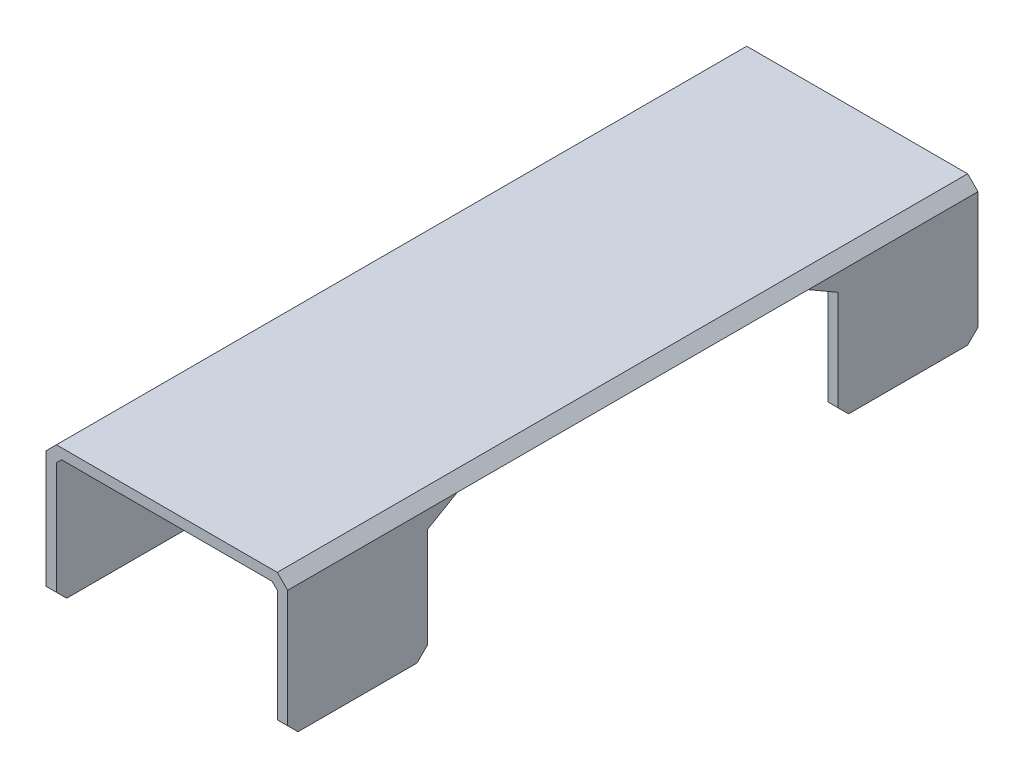
ISO-10303-21;
HEADER;
FILE_DESCRIPTION(('STEP AP214'),'2;1');
FILE_NAME('part.step','',(''),(''),'','','');
FILE_SCHEMA(('AUTOMOTIVE_DESIGN { 1 0 10303 214 1 1 1 1 }'));
ENDSEC;
DATA;
#1=APPLICATION_CONTEXT('core data for automotive mechanical design processes');
#2=APPLICATION_PROTOCOL_DEFINITION('international standard','automotive_design',2000,#1);
#3=PRODUCT_CONTEXT('',#1,'mechanical');
#4=PRODUCT('Part','Part','',(#3));
#5=PRODUCT_RELATED_PRODUCT_CATEGORY('part','',(#4));
#6=PRODUCT_DEFINITION_FORMATION('','',#4);
#7=PRODUCT_DEFINITION_CONTEXT('part definition',#1,'design');
#8=PRODUCT_DEFINITION('design','',#6,#7);
#9=PRODUCT_DEFINITION_SHAPE('','',#8);
#10=(LENGTH_UNIT() NAMED_UNIT(*) SI_UNIT(.MILLI.,.METRE.));
#11=(NAMED_UNIT(*) PLANE_ANGLE_UNIT() SI_UNIT($,.RADIAN.));
#12=(NAMED_UNIT(*) SI_UNIT($,.STERADIAN.) SOLID_ANGLE_UNIT());
#13=UNCERTAINTY_MEASURE_WITH_UNIT(LENGTH_MEASURE(1.E-05),#10,'distance_accuracy_value','');
#14=(GEOMETRIC_REPRESENTATION_CONTEXT(3) GLOBAL_UNCERTAINTY_ASSIGNED_CONTEXT((#13)) GLOBAL_UNIT_ASSIGNED_CONTEXT((#10,
#11,#12)) REPRESENTATION_CONTEXT('',''));
#15=CARTESIAN_POINT('',(0.,0.,0.));
#16=DIRECTION('',(0.,0.,1.));
#17=DIRECTION('',(1.,0.,0.));
#18=AXIS2_PLACEMENT_3D('',#15,#16,#17);
#19=CARTESIAN_POINT('',(32.,3.,-140.112342240263));
#20=DIRECTION('',(-1.,0.,0.));
#21=DIRECTION('',(0.,-1.,0.));
#22=AXIS2_PLACEMENT_3D('',#19,#20,#21);
#23=PLANE('',#22);
#24=DIRECTION('',(0.,1.,0.));
#25=VECTOR('',#24,1.);
#26=CARTESIAN_POINT('',(32.,3.,-100.));
#27=LINE('',#26,#25);
#28=CARTESIAN_POINT('',(32.,-34.,-100.));
#29=VERTEX_POINT('',#28);
#30=CARTESIAN_POINT('',(32.,-1.5,-100.));
#31=VERTEX_POINT('',#30);
#32=EDGE_CURVE('E570',#29,#31,#27,.T.);
#33=ORIENTED_EDGE('',*,*,#32,.F.);
#34=DIRECTION('',(0.,-0.707106781186548,0.707106781186548));
#35=VECTOR('',#34,1.);
#36=CARTESIAN_POINT('',(32.,4.5561711201316,-138.556171120132));
#37=LINE('',#36,#35);
#38=CARTESIAN_POINT('',(32.,-37.,-97.));
#39=VERTEX_POINT('',#38);
#40=EDGE_CURVE('E445',#29,#39,#37,.T.);
#41=ORIENTED_EDGE('',*,*,#40,.T.);
#42=DIRECTION('',(0.,0.,1.));
#43=VECTOR('',#42,1.);
#44=CARTESIAN_POINT('',(32.,-37.,-140.112342240263));
#45=LINE('',#44,#43);
#46=CARTESIAN_POINT('',(32.,-37.,-62.5));
#47=VERTEX_POINT('',#46);
#48=EDGE_CURVE('E584',#39,#47,#45,.T.);
#49=ORIENTED_EDGE('',*,*,#48,.T.);
#50=DIRECTION('',(0.,0.707106781186543,0.707106781186552));
#51=VECTOR('',#50,1.);
#52=CARTESIAN_POINT('',(32.,-55.8061711201318,-81.306171120132));
#53=LINE('',#52,#51);
#54=CARTESIAN_POINT('',(32.,-34.,-59.5));
#55=VERTEX_POINT('',#54);
#56=EDGE_CURVE('E442',#47,#55,#53,.T.);
#57=ORIENTED_EDGE('',*,*,#56,.T.);
#58=DIRECTION('',(0.,-1.,0.));
#59=VECTOR('',#58,1.);
#60=CARTESIAN_POINT('',(32.,2.99999999999998,-59.5));
#61=LINE('',#60,#59);
#62=CARTESIAN_POINT('',(32.,-4.99999999999998,-59.5));
#63=VERTEX_POINT('',#62);
#64=EDGE_CURVE('E539',#63,#55,#61,.T.);
#65=ORIENTED_EDGE('',*,*,#64,.F.);
#66=DIRECTION('',(0.,0.499999999999995,0.866025403784441));
#67=VECTOR('',#66,1.);
#68=CARTESIAN_POINT('',(32.,0.,-50.8397459621555));
#69=LINE('',#68,#67);
#70=CARTESIAN_POINT('',(32.,-1.5,-53.4378221735089));
#71=VERTEX_POINT('',#70);
#72=EDGE_CURVE('E395',#63,#71,#69,.T.);
#73=ORIENTED_EDGE('',*,*,#72,.T.);
#74=DIRECTION('',(0.,0.,-1.));
#75=VECTOR('',#74,1.);
#76=CARTESIAN_POINT('',(32.,-1.5,-100.));
#77=LINE('',#76,#75);
#78=EDGE_CURVE('E322',#71,#31,#77,.T.);
#79=ORIENTED_EDGE('',*,*,#78,.T.);
#80=EDGE_LOOP('',(#33,#41,#49,#57,#65,#73,#79));
#81=FACE_BOUND('',#80,.T.);
#82=ADVANCED_FACE('F45',(#81),#23,.T.);
#83=CARTESIAN_POINT('',(35.,3.,-140.112342240263));
#84=DIRECTION('',(1.,0.,0.));
#85=DIRECTION('',(0.,1.,0.));
#86=AXIS2_PLACEMENT_3D('',#83,#84,#85);
#87=PLANE('',#86);
#88=DIRECTION('',(0.,0.,1.));
#89=VECTOR('',#88,1.);
#90=CARTESIAN_POINT('',(35.,-37.,-140.112342240263));
#91=LINE('',#90,#89);
#92=CARTESIAN_POINT('',(35.,-37.,-97.));
#93=VERTEX_POINT('',#92);
#94=CARTESIAN_POINT('',(35.,-37.,-62.5));
#95=VERTEX_POINT('',#94);
#96=EDGE_CURVE('E571',#93,#95,#91,.T.);
#97=ORIENTED_EDGE('',*,*,#96,.F.);
#98=DIRECTION('',(0.,0.707106781186548,-0.707106781186548));
#99=VECTOR('',#98,1.);
#100=CARTESIAN_POINT('',(35.,4.5561711201316,-138.556171120132));
#101=LINE('',#100,#99);
#102=CARTESIAN_POINT('',(35.,-34.,-100.));
#103=VERTEX_POINT('',#102);
#104=EDGE_CURVE('E457',#93,#103,#101,.T.);
#105=ORIENTED_EDGE('',*,*,#104,.T.);
#106=DIRECTION('',(0.,-1.,0.));
#107=VECTOR('',#106,1.);
#108=CARTESIAN_POINT('',(35.,3.,-100.));
#109=LINE('',#108,#107);
#110=CARTESIAN_POINT('',(35.,0.,-100.));
#111=VERTEX_POINT('',#110);
#112=EDGE_CURVE('E567',#111,#103,#109,.T.);
#113=ORIENTED_EDGE('',*,*,#112,.F.);
#114=DIRECTION('',(0.,0.,1.));
#115=VECTOR('',#114,1.);
#116=CARTESIAN_POINT('',(35.,0.,100.));
#117=LINE('',#116,#115);
#118=CARTESIAN_POINT('',(35.,0.,-50.8397459621555));
#119=VERTEX_POINT('',#118);
#120=EDGE_CURVE('E334',#111,#119,#117,.T.);
#121=ORIENTED_EDGE('',*,*,#120,.T.);
#122=DIRECTION('',(0.,-0.499999999999995,-0.866025403784441));
#123=VECTOR('',#122,1.);
#124=CARTESIAN_POINT('',(35.,0.,-50.8397459621555));
#125=LINE('',#124,#123);
#126=CARTESIAN_POINT('',(35.,-4.99999999999998,-59.5));
#127=VERTEX_POINT('',#126);
#128=EDGE_CURVE('E391',#119,#127,#125,.T.);
#129=ORIENTED_EDGE('',*,*,#128,.T.);
#130=DIRECTION('',(0.,1.,0.));
#131=VECTOR('',#130,1.);
#132=CARTESIAN_POINT('',(35.,0.,-59.5));
#133=LINE('',#132,#131);
#134=CARTESIAN_POINT('',(35.,-34.,-59.5));
#135=VERTEX_POINT('',#134);
#136=EDGE_CURVE('E630',#135,#127,#133,.T.);
#137=ORIENTED_EDGE('',*,*,#136,.F.);
#138=DIRECTION('',(0.,-0.707106781186543,-0.707106781186552));
#139=VECTOR('',#138,1.);
#140=CARTESIAN_POINT('',(35.,-55.8061711201318,-81.306171120132));
#141=LINE('',#140,#139);
#142=EDGE_CURVE('E454',#135,#95,#141,.T.);
#143=ORIENTED_EDGE('',*,*,#142,.T.);
#144=EDGE_LOOP('',(#97,#105,#113,#121,#129,#137,#143));
#145=FACE_BOUND('',#144,.T.);
#146=ADVANCED_FACE('F696',(#145),#87,.T.);
#147=CARTESIAN_POINT('',(32.,-37.,-140.112342240263));
#148=DIRECTION('',(0.,-1.,0.));
#149=DIRECTION('',(0.,0.,-1.));
#150=AXIS2_PLACEMENT_3D('',#147,#148,#149);
#151=PLANE('',#150);
#152=ORIENTED_EDGE('',*,*,#48,.F.);
#153=DIRECTION('',(1.,0.,0.));
#154=VECTOR('',#153,1.);
#155=CARTESIAN_POINT('',(35.,-37.,-97.));
#156=LINE('',#155,#154);
#157=EDGE_CURVE('E451',#39,#93,#156,.T.);
#158=ORIENTED_EDGE('',*,*,#157,.T.);
#159=ORIENTED_EDGE('',*,*,#96,.T.);
#160=DIRECTION('',(-1.,0.,0.));
#161=VECTOR('',#160,1.);
#162=CARTESIAN_POINT('',(32.,-37.,-62.5));
#163=LINE('',#162,#161);
#164=EDGE_CURVE('E448',#95,#47,#163,.T.);
#165=ORIENTED_EDGE('',*,*,#164,.T.);
#166=EDGE_LOOP('',(#152,#158,#159,#165));
#167=FACE_BOUND('',#166,.T.);
#168=ADVANCED_FACE('F724',(#167),#151,.T.);
#169=CARTESIAN_POINT('',(-32.,3.,-140.112342240263));
#170=DIRECTION('',(1.,0.,0.));
#171=DIRECTION('',(0.,1.,0.));
#172=AXIS2_PLACEMENT_3D('',#169,#170,#171);
#173=PLANE('',#172);
#174=DIRECTION('',(0.,0.,1.));
#175=VECTOR('',#174,1.);
#176=CARTESIAN_POINT('',(-32.,-37.,-140.112342240263));
#177=LINE('',#176,#175);
#178=CARTESIAN_POINT('',(-32.,-37.,-97.));
#179=VERTEX_POINT('',#178);
#180=CARTESIAN_POINT('',(-32.,-37.,-62.5));
#181=VERTEX_POINT('',#180);
#182=EDGE_CURVE('E552',#179,#181,#177,.T.);
#183=ORIENTED_EDGE('',*,*,#182,.F.);
#184=DIRECTION('',(0.,0.707106781186548,-0.707106781186548));
#185=VECTOR('',#184,1.);
#186=CARTESIAN_POINT('',(-32.,4.5561711201316,-138.556171120132));
#187=LINE('',#186,#185);
#188=CARTESIAN_POINT('',(-32.,-34.,-100.));
#189=VERTEX_POINT('',#188);
#190=EDGE_CURVE('E294',#179,#189,#187,.T.);
#191=ORIENTED_EDGE('',*,*,#190,.T.);
#192=DIRECTION('',(0.,-1.,0.));
#193=VECTOR('',#192,1.);
#194=CARTESIAN_POINT('',(-32.,3.,-100.));
#195=LINE('',#194,#193);
#196=CARTESIAN_POINT('',(-32.,-1.5,-100.));
#197=VERTEX_POINT('',#196);
#198=EDGE_CURVE('E277',#197,#189,#195,.T.);
#199=ORIENTED_EDGE('',*,*,#198,.F.);
#200=DIRECTION('',(0.,0.,1.));
#201=VECTOR('',#200,1.);
#202=CARTESIAN_POINT('',(-32.,-1.5,100.));
#203=LINE('',#202,#201);
#204=CARTESIAN_POINT('',(-32.,-1.5,-53.4378221735089));
#205=VERTEX_POINT('',#204);
#206=EDGE_CURVE('E291',#197,#205,#203,.T.);
#207=ORIENTED_EDGE('',*,*,#206,.T.);
#208=DIRECTION('',(0.,-0.499999999999995,-0.866025403784441));
#209=VECTOR('',#208,1.);
#210=CARTESIAN_POINT('',(-32.,0.,-50.8397459621555));
#211=LINE('',#210,#209);
#212=CARTESIAN_POINT('',(-32.,-4.99999999999999,-59.5));
#213=VERTEX_POINT('',#212);
#214=EDGE_CURVE('E405',#205,#213,#211,.T.);
#215=ORIENTED_EDGE('',*,*,#214,.T.);
#216=DIRECTION('',(0.,1.,0.));
#217=VECTOR('',#216,1.);
#218=CARTESIAN_POINT('',(-32.,2.99999999999998,-59.5));
#219=LINE('',#218,#217);
#220=CARTESIAN_POINT('',(-32.,-34.,-59.5));
#221=VERTEX_POINT('',#220);
#222=EDGE_CURVE('E297',#221,#213,#219,.T.);
#223=ORIENTED_EDGE('',*,*,#222,.F.);
#224=DIRECTION('',(0.,-0.707106781186545,-0.70710678118655));
#225=VECTOR('',#224,1.);
#226=CARTESIAN_POINT('',(-32.,-55.8061711201317,-81.3061711201319));
#227=LINE('',#226,#225);
#228=EDGE_CURVE('E472',#221,#181,#227,.T.);
#229=ORIENTED_EDGE('',*,*,#228,.T.);
#230=EDGE_LOOP('',(#183,#191,#199,#207,#215,#223,#229));
#231=FACE_BOUND('',#230,.T.);
#232=ADVANCED_FACE('F289',(#231),#173,.T.);
#233=CARTESIAN_POINT('',(-32.,-37.,-140.112342240263));
#234=DIRECTION('',(0.,-1.,0.));
#235=DIRECTION('',(0.,0.,-1.));
#236=AXIS2_PLACEMENT_3D('',#233,#234,#235);
#237=PLANE('',#236);
#238=DIRECTION('',(0.,0.,1.));
#239=VECTOR('',#238,1.);
#240=CARTESIAN_POINT('',(-35.,-37.,-140.112342240263));
#241=LINE('',#240,#239);
#242=CARTESIAN_POINT('',(-35.,-37.,-97.));
#243=VERTEX_POINT('',#242);
#244=CARTESIAN_POINT('',(-35.,-37.,-62.5));
#245=VERTEX_POINT('',#244);
#246=EDGE_CURVE('E551',#243,#245,#241,.T.);
#247=ORIENTED_EDGE('',*,*,#246,.F.);
#248=DIRECTION('',(1.,0.,0.));
#249=VECTOR('',#248,1.);
#250=CARTESIAN_POINT('',(-32.,-37.,-97.));
#251=LINE('',#250,#249);
#252=EDGE_CURVE('E469',#243,#179,#251,.T.);
#253=ORIENTED_EDGE('',*,*,#252,.T.);
#254=ORIENTED_EDGE('',*,*,#182,.T.);
#255=DIRECTION('',(-1.,0.,0.));
#256=VECTOR('',#255,1.);
#257=CARTESIAN_POINT('',(-35.,-37.,-62.5));
#258=LINE('',#257,#256);
#259=EDGE_CURVE('E466',#181,#245,#258,.T.);
#260=ORIENTED_EDGE('',*,*,#259,.T.);
#261=EDGE_LOOP('',(#247,#253,#254,#260));
#262=FACE_BOUND('',#261,.T.);
#263=ADVANCED_FACE('F734',(#262),#237,.T.);
#264=CARTESIAN_POINT('',(-35.,3.,-140.112342240263));
#265=DIRECTION('',(-1.,0.,0.));
#266=DIRECTION('',(0.,-1.,0.));
#267=AXIS2_PLACEMENT_3D('',#264,#265,#266);
#268=PLANE('',#267);
#269=DIRECTION('',(0.,1.,0.));
#270=VECTOR('',#269,1.);
#271=CARTESIAN_POINT('',(-35.,3.,-100.));
#272=LINE('',#271,#270);
#273=CARTESIAN_POINT('',(-35.,-34.,-100.));
#274=VERTEX_POINT('',#273);
#275=CARTESIAN_POINT('',(-35.,0.,-100.));
#276=VERTEX_POINT('',#275);
#277=EDGE_CURVE('E296',#274,#276,#272,.T.);
#278=ORIENTED_EDGE('',*,*,#277,.F.);
#279=DIRECTION('',(0.,-0.707106781186548,0.707106781186548));
#280=VECTOR('',#279,1.);
#281=CARTESIAN_POINT('',(-35.,4.5561711201316,-138.556171120132));
#282=LINE('',#281,#280);
#283=EDGE_CURVE('E463',#274,#243,#282,.T.);
#284=ORIENTED_EDGE('',*,*,#283,.T.);
#285=ORIENTED_EDGE('',*,*,#246,.T.);
#286=DIRECTION('',(0.,0.707106781186545,0.70710678118655));
#287=VECTOR('',#286,1.);
#288=CARTESIAN_POINT('',(-35.,-55.8061711201317,-81.3061711201319));
#289=LINE('',#288,#287);
#290=CARTESIAN_POINT('',(-35.,-34.,-59.5));
#291=VERTEX_POINT('',#290);
#292=EDGE_CURVE('E460',#245,#291,#289,.T.);
#293=ORIENTED_EDGE('',*,*,#292,.T.);
#294=DIRECTION('',(0.,1.,0.));
#295=VECTOR('',#294,1.);
#296=CARTESIAN_POINT('',(-35.,0.,-59.5));
#297=LINE('',#296,#295);
#298=CARTESIAN_POINT('',(-35.,-4.99999999999999,-59.5));
#299=VERTEX_POINT('',#298);
#300=EDGE_CURVE('E533',#291,#299,#297,.T.);
#301=ORIENTED_EDGE('',*,*,#300,.T.);
#302=DIRECTION('',(0.,0.499999999999995,0.866025403784441));
#303=VECTOR('',#302,1.);
#304=CARTESIAN_POINT('',(-35.,0.,-50.8397459621555));
#305=LINE('',#304,#303);
#306=CARTESIAN_POINT('',(-35.,0.,-50.8397459621555));
#307=VERTEX_POINT('',#306);
#308=EDGE_CURVE('E408',#299,#307,#305,.T.);
#309=ORIENTED_EDGE('',*,*,#308,.T.);
#310=DIRECTION('',(0.,0.,-1.));
#311=VECTOR('',#310,1.);
#312=CARTESIAN_POINT('',(-35.,0.,-100.));
#313=LINE('',#312,#311);
#314=EDGE_CURVE('E356',#307,#276,#313,.T.);
#315=ORIENTED_EDGE('',*,*,#314,.T.);
#316=EDGE_LOOP('',(#278,#284,#285,#293,#301,#309,#315));
#317=FACE_BOUND('',#316,.T.);
#318=ADVANCED_FACE('F739',(#317),#268,.T.);
#319=CARTESIAN_POINT('',(-32.,-1.5,-140.112342240263));
#320=DIRECTION('',(0.707106781186547,-0.707106781186547,0.));
#321=DIRECTION('',(0.,0.,-1.));
#322=AXIS2_PLACEMENT_3D('',#319,#320,#321);
#323=PLANE('',#322);
#324=DIRECTION('',(0.,0.,-1.));
#325=VECTOR('',#324,1.);
#326=CARTESIAN_POINT('',(-30.5,0.,-100.));
#327=LINE('',#326,#325);
#328=CARTESIAN_POINT('',(-30.5,0.,-50.8397459621555));
#329=VERTEX_POINT('',#328);
#330=CARTESIAN_POINT('',(-30.5,0.,-100.));
#331=VERTEX_POINT('',#330);
#332=EDGE_CURVE('E318',#329,#331,#327,.T.);
#333=ORIENTED_EDGE('',*,*,#332,.F.);
#334=DIRECTION('',(0.447213595499954,0.447213595499954,0.774596669241488));
#335=VECTOR('',#334,1.);
#336=CARTESIAN_POINT('',(-62.0249344954532,-31.5249344954533,-105.442534213562));
#337=LINE('',#336,#335);
#338=EDGE_CURVE('E301',#329,#205,#337,.F.);
#339=ORIENTED_EDGE('',*,*,#338,.T.);
#340=ORIENTED_EDGE('',*,*,#206,.F.);
#341=DIRECTION('',(0.707106781186548,0.707106781186548,0.));
#342=VECTOR('',#341,1.);
#343=CARTESIAN_POINT('',(-29.75,0.749999999999999,-100.));
#344=LINE('',#343,#342);
#345=EDGE_CURVE('E272',#331,#197,#344,.F.);
#346=ORIENTED_EDGE('',*,*,#345,.F.);
#347=EDGE_LOOP('',(#333,#339,#340,#346));
#348=FACE_BOUND('',#347,.T.);
#349=ADVANCED_FACE('F299',(#348),#323,.T.);
#350=CARTESIAN_POINT('',(32.,-1.5,-140.112342240263));
#351=DIRECTION('',(-0.707106781186547,-0.707106781186547,0.));
#352=DIRECTION('',(0.,0.,1.));
#353=AXIS2_PLACEMENT_3D('',#350,#351,#352);
#354=PLANE('',#353);
#355=ORIENTED_EDGE('',*,*,#78,.F.);
#356=DIRECTION('',(0.447213595499955,-0.447213595499954,-0.774596669241487));
#357=VECTOR('',#356,1.);
#358=CARTESIAN_POINT('',(62.0249344954533,-31.5249344954533,-105.442534213562));
#359=LINE('',#358,#357);
#360=CARTESIAN_POINT('',(30.5,0.,-50.8397459621555));
#361=VERTEX_POINT('',#360);
#362=EDGE_CURVE('E399',#71,#361,#359,.F.);
#363=ORIENTED_EDGE('',*,*,#362,.T.);
#364=DIRECTION('',(0.,0.,1.));
#365=VECTOR('',#364,1.);
#366=CARTESIAN_POINT('',(30.5,0.,100.));
#367=LINE('',#366,#365);
#368=CARTESIAN_POINT('',(30.5,0.,-100.));
#369=VERTEX_POINT('',#368);
#370=EDGE_CURVE('E309',#369,#361,#367,.T.);
#371=ORIENTED_EDGE('',*,*,#370,.F.);
#372=DIRECTION('',(0.707106781186548,-0.707106781186548,0.));
#373=VECTOR('',#372,1.);
#374=CARTESIAN_POINT('',(-2.25,32.75,-100.));
#375=LINE('',#374,#373);
#376=EDGE_CURVE('E284',#31,#369,#375,.F.);
#377=ORIENTED_EDGE('',*,*,#376,.F.);
#378=EDGE_LOOP('',(#355,#363,#371,#377));
#379=FACE_BOUND('',#378,.T.);
#380=ADVANCED_FACE('F708',(#379),#354,.T.);
#381=CARTESIAN_POINT('',(-32.,3.,-100.));
#382=DIRECTION('',(0.,0.,1.));
#383=DIRECTION('',(1.,0.,0.));
#384=AXIS2_PLACEMENT_3D('',#381,#382,#383);
#385=PLANE('',#384);
#386=ORIENTED_EDGE('',*,*,#112,.T.);
#387=DIRECTION('',(-1.,0.,0.));
#388=VECTOR('',#387,1.);
#389=CARTESIAN_POINT('',(32.,-34.,-100.));
#390=LINE('',#389,#388);
#391=EDGE_CURVE('E438',#103,#29,#390,.T.);
#392=ORIENTED_EDGE('',*,*,#391,.T.);
#393=ORIENTED_EDGE('',*,*,#32,.T.);
#394=ORIENTED_EDGE('',*,*,#376,.T.);
#395=DIRECTION('',(-1.,0.,0.));
#396=VECTOR('',#395,1.);
#397=CARTESIAN_POINT('',(-32.,0.,-100.));
#398=LINE('',#397,#396);
#399=EDGE_CURVE('E280',#369,#331,#398,.T.);
#400=ORIENTED_EDGE('',*,*,#399,.T.);
#401=ORIENTED_EDGE('',*,*,#345,.T.);
#402=ORIENTED_EDGE('',*,*,#198,.T.);
#403=DIRECTION('',(-1.,0.,0.));
#404=VECTOR('',#403,1.);
#405=CARTESIAN_POINT('',(-35.,-34.,-100.));
#406=LINE('',#405,#404);
#407=EDGE_CURVE('E435',#189,#274,#406,.T.);
#408=ORIENTED_EDGE('',*,*,#407,.T.);
#409=ORIENTED_EDGE('',*,*,#277,.T.);
#410=DIRECTION('',(0.707106781186548,0.707106781186548,0.));
#411=VECTOR('',#410,1.);
#412=CARTESIAN_POINT('',(-32.,3.,-100.));
#413=LINE('',#412,#411);
#414=CARTESIAN_POINT('',(-32.,3.,-100.));
#415=VERTEX_POINT('',#414);
#416=EDGE_CURVE('E350',#276,#415,#413,.T.);
#417=ORIENTED_EDGE('',*,*,#416,.T.);
#418=DIRECTION('',(-1.,0.,0.));
#419=VECTOR('',#418,1.);
#420=CARTESIAN_POINT('',(-32.,3.,-100.));
#421=LINE('',#420,#419);
#422=CARTESIAN_POINT('',(32.,3.,-100.));
#423=VERTEX_POINT('',#422);
#424=EDGE_CURVE('E587',#423,#415,#421,.T.);
#425=ORIENTED_EDGE('',*,*,#424,.F.);
#426=DIRECTION('',(0.707106781186548,-0.707106781186548,0.));
#427=VECTOR('',#426,1.);
#428=CARTESIAN_POINT('',(35.,0.,-100.));
#429=LINE('',#428,#427);
#430=EDGE_CURVE('E353',#423,#111,#429,.T.);
#431=ORIENTED_EDGE('',*,*,#430,.T.);
#432=EDGE_LOOP('',(#386,#392,#393,#394,#400,#401,#402,#408,#409,#417,#425,#431));
#433=FACE_BOUND('',#432,.T.);
#434=ADVANCED_FACE('F275',(#433),#385,.F.);
#435=CARTESIAN_POINT('',(-32.,3.,100.));
#436=DIRECTION('',(0.,0.,-1.));
#437=DIRECTION('',(-1.,0.,0.));
#438=AXIS2_PLACEMENT_3D('',#435,#436,#437);
#439=PLANE('',#438);
#440=DIRECTION('',(0.,-1.,0.));
#441=VECTOR('',#440,1.);
#442=CARTESIAN_POINT('',(-35.,3.,100.));
#443=LINE('',#442,#441);
#444=CARTESIAN_POINT('',(-35.,0.,100.));
#445=VERTEX_POINT('',#444);
#446=CARTESIAN_POINT('',(-35.,-34.,100.));
#447=VERTEX_POINT('',#446);
#448=EDGE_CURVE('E557',#445,#447,#443,.T.);
#449=ORIENTED_EDGE('',*,*,#448,.T.);
#450=DIRECTION('',(1.,0.,0.));
#451=VECTOR('',#450,1.);
#452=CARTESIAN_POINT('',(-32.,-34.,100.));
#453=LINE('',#452,#451);
#454=CARTESIAN_POINT('',(-32.,-34.,100.));
#455=VERTEX_POINT('',#454);
#456=EDGE_CURVE('E481',#447,#455,#453,.T.);
#457=ORIENTED_EDGE('',*,*,#456,.T.);
#458=DIRECTION('',(0.,1.,0.));
#459=VECTOR('',#458,1.);
#460=CARTESIAN_POINT('',(-32.,3.,100.));
#461=LINE('',#460,#459);
#462=CARTESIAN_POINT('',(-32.,-1.5,100.));
#463=VERTEX_POINT('',#462);
#464=EDGE_CURVE('E561',#455,#463,#461,.T.);
#465=ORIENTED_EDGE('',*,*,#464,.T.);
#466=DIRECTION('',(-0.707106781186548,-0.707106781186548,0.));
#467=VECTOR('',#466,1.);
#468=CARTESIAN_POINT('',(-29.75,0.749999999999999,100.));
#469=LINE('',#468,#467);
#470=CARTESIAN_POINT('',(-30.5,0.,100.));
#471=VERTEX_POINT('',#470);
#472=EDGE_CURVE('E285',#463,#471,#469,.F.);
#473=ORIENTED_EDGE('',*,*,#472,.T.);
#474=DIRECTION('',(1.,0.,0.));
#475=VECTOR('',#474,1.);
#476=CARTESIAN_POINT('',(-32.,0.,100.));
#477=LINE('',#476,#475);
#478=CARTESIAN_POINT('',(30.5,0.,100.));
#479=VERTEX_POINT('',#478);
#480=EDGE_CURVE('E314',#471,#479,#477,.T.);
#481=ORIENTED_EDGE('',*,*,#480,.T.);
#482=DIRECTION('',(-0.707106781186548,0.707106781186548,0.));
#483=VECTOR('',#482,1.);
#484=CARTESIAN_POINT('',(-2.25,32.75,100.));
#485=LINE('',#484,#483);
#486=CARTESIAN_POINT('',(32.,-1.5,100.));
#487=VERTEX_POINT('',#486);
#488=EDGE_CURVE('E330',#479,#487,#485,.F.);
#489=ORIENTED_EDGE('',*,*,#488,.T.);
#490=DIRECTION('',(0.,-1.,0.));
#491=VECTOR('',#490,1.);
#492=CARTESIAN_POINT('',(32.,3.,100.));
#493=LINE('',#492,#491);
#494=CARTESIAN_POINT('',(32.,-34.,100.));
#495=VERTEX_POINT('',#494);
#496=EDGE_CURVE('E563',#487,#495,#493,.T.);
#497=ORIENTED_EDGE('',*,*,#496,.T.);
#498=DIRECTION('',(1.,0.,0.));
#499=VECTOR('',#498,1.);
#500=CARTESIAN_POINT('',(35.,-34.,100.));
#501=LINE('',#500,#499);
#502=CARTESIAN_POINT('',(35.,-34.,100.));
#503=VERTEX_POINT('',#502);
#504=EDGE_CURVE('E477',#495,#503,#501,.T.);
#505=ORIENTED_EDGE('',*,*,#504,.T.);
#506=DIRECTION('',(0.,1.,0.));
#507=VECTOR('',#506,1.);
#508=CARTESIAN_POINT('',(35.,3.,100.));
#509=LINE('',#508,#507);
#510=CARTESIAN_POINT('',(35.,0.,100.));
#511=VERTEX_POINT('',#510);
#512=EDGE_CURVE('E577',#503,#511,#509,.T.);
#513=ORIENTED_EDGE('',*,*,#512,.T.);
#514=DIRECTION('',(-0.707106781186548,0.707106781186548,0.));
#515=VECTOR('',#514,1.);
#516=CARTESIAN_POINT('',(35.,0.,100.));
#517=LINE('',#516,#515);
#518=CARTESIAN_POINT('',(32.,3.,100.));
#519=VERTEX_POINT('',#518);
#520=EDGE_CURVE('E340',#511,#519,#517,.T.);
#521=ORIENTED_EDGE('',*,*,#520,.T.);
#522=DIRECTION('',(1.,0.,0.));
#523=VECTOR('',#522,1.);
#524=CARTESIAN_POINT('',(-32.,3.,100.));
#525=LINE('',#524,#523);
#526=CARTESIAN_POINT('',(-32.,3.,100.));
#527=VERTEX_POINT('',#526);
#528=EDGE_CURVE('E312',#527,#519,#525,.T.);
#529=ORIENTED_EDGE('',*,*,#528,.F.);
#530=DIRECTION('',(-0.707106781186548,-0.707106781186548,0.));
#531=VECTOR('',#530,1.);
#532=CARTESIAN_POINT('',(-32.,3.,100.));
#533=LINE('',#532,#531);
#534=EDGE_CURVE('E337',#527,#445,#533,.T.);
#535=ORIENTED_EDGE('',*,*,#534,.T.);
#536=EDGE_LOOP('',(#449,#457,#465,#473,#481,#489,#497,#505,#513,#521,#529,#535));
#537=FACE_BOUND('',#536,.T.);
#538=ADVANCED_FACE('F599',(#537),#439,.F.);
#539=CARTESIAN_POINT('',(0.,3.,0.));
#540=DIRECTION('',(0.,-1.,0.));
#541=DIRECTION('',(0.,0.,-1.));
#542=AXIS2_PLACEMENT_3D('',#539,#540,#541);
#543=PLANE('',#542);
#544=ORIENTED_EDGE('',*,*,#528,.T.);
#545=DIRECTION('',(0.,0.,-1.));
#546=VECTOR('',#545,1.);
#547=CARTESIAN_POINT('',(32.,3.,-100.));
#548=LINE('',#547,#546);
#549=EDGE_CURVE('E347',#519,#423,#548,.T.);
#550=ORIENTED_EDGE('',*,*,#549,.T.);
#551=ORIENTED_EDGE('',*,*,#424,.T.);
#552=DIRECTION('',(0.,0.,1.));
#553=VECTOR('',#552,1.);
#554=CARTESIAN_POINT('',(-32.,3.,100.));
#555=LINE('',#554,#553);
#556=EDGE_CURVE('E343',#415,#527,#555,.T.);
#557=ORIENTED_EDGE('',*,*,#556,.T.);
#558=EDGE_LOOP('',(#544,#550,#551,#557));
#559=FACE_BOUND('',#558,.T.);
#560=ADVANCED_FACE('F682',(#559),#543,.F.);
#561=CARTESIAN_POINT('',(0.,0.,0.));
#562=DIRECTION('',(0.,-1.,0.));
#563=DIRECTION('',(0.,0.,-1.));
#564=AXIS2_PLACEMENT_3D('',#561,#562,#563);
#565=PLANE('',#564);
#566=ORIENTED_EDGE('',*,*,#370,.T.);
#567=DIRECTION('',(1.,0.,0.));
#568=VECTOR('',#567,1.);
#569=CARTESIAN_POINT('',(0.,0.,-50.8397459621555));
#570=LINE('',#569,#568);
#571=EDGE_CURVE('E372',#361,#119,#570,.T.);
#572=ORIENTED_EDGE('',*,*,#571,.T.);
#573=DIRECTION('',(0.,0.,1.));
#574=VECTOR('',#573,1.);
#575=CARTESIAN_POINT('',(35.,0.,59.5));
#576=LINE('',#575,#574);
#577=CARTESIAN_POINT('',(35.,0.,50.8397459621555));
#578=VERTEX_POINT('',#577);
#579=EDGE_CURVE('E633',#119,#578,#576,.T.);
#580=ORIENTED_EDGE('',*,*,#579,.T.);
#581=DIRECTION('',(-1.,0.,0.));
#582=VECTOR('',#581,1.);
#583=CARTESIAN_POINT('',(0.,0.,50.8397459621555));
#584=LINE('',#583,#582);
#585=CARTESIAN_POINT('',(30.5,0.,50.8397459621555));
#586=VERTEX_POINT('',#585);
#587=EDGE_CURVE('E364',#578,#586,#584,.T.);
#588=ORIENTED_EDGE('',*,*,#587,.T.);
#589=EDGE_CURVE('E304',#586,#479,#367,.T.);
#590=ORIENTED_EDGE('',*,*,#589,.T.);
#591=ORIENTED_EDGE('',*,*,#480,.F.);
#592=CARTESIAN_POINT('',(-30.5,0.,50.8397459621555));
#593=VERTEX_POINT('',#592);
#594=EDGE_CURVE('E319',#471,#593,#327,.T.);
#595=ORIENTED_EDGE('',*,*,#594,.T.);
#596=DIRECTION('',(-1.,0.,0.));
#597=VECTOR('',#596,1.);
#598=CARTESIAN_POINT('',(0.,0.,50.8397459621555));
#599=LINE('',#598,#597);
#600=CARTESIAN_POINT('',(-35.,0.,50.8397459621555));
#601=VERTEX_POINT('',#600);
#602=EDGE_CURVE('E360',#593,#601,#599,.T.);
#603=ORIENTED_EDGE('',*,*,#602,.T.);
#604=DIRECTION('',(0.,0.,1.));
#605=VECTOR('',#604,1.);
#606=CARTESIAN_POINT('',(-35.,0.,59.5));
#607=LINE('',#606,#605);
#608=EDGE_CURVE('E642',#307,#601,#607,.T.);
#609=ORIENTED_EDGE('',*,*,#608,.F.);
#610=DIRECTION('',(1.,0.,0.));
#611=VECTOR('',#610,1.);
#612=CARTESIAN_POINT('',(0.,0.,-50.8397459621555));
#613=LINE('',#612,#611);
#614=EDGE_CURVE('E368',#307,#329,#613,.T.);
#615=ORIENTED_EDGE('',*,*,#614,.T.);
#616=ORIENTED_EDGE('',*,*,#332,.T.);
#617=ORIENTED_EDGE('',*,*,#399,.F.);
#618=EDGE_LOOP('',(#566,#572,#580,#588,#590,#591,#595,#603,#609,#615,#616,#617));
#619=FACE_BOUND('',#618,.T.);
#620=ADVANCED_FACE('F704',(#619),#565,.T.);
#621=CARTESIAN_POINT('',(32.,-37.,62.5));
#622=VERTEX_POINT('',#621);
#623=CARTESIAN_POINT('',(32.,-37.,97.));
#624=VERTEX_POINT('',#623);
#625=EDGE_CURVE('E580',#622,#624,#45,.T.);
#626=ORIENTED_EDGE('',*,*,#625,.T.);
#627=DIRECTION('',(0.,0.707106781186548,0.707106781186548));
#628=VECTOR('',#627,1.);
#629=CARTESIAN_POINT('',(32.,-135.556171120132,-1.55617112013162));
#630=LINE('',#629,#628);
#631=EDGE_CURVE('E519',#624,#495,#630,.T.);
#632=ORIENTED_EDGE('',*,*,#631,.T.);
#633=ORIENTED_EDGE('',*,*,#496,.F.);
#634=CARTESIAN_POINT('',(32.,-1.5,53.4378221735089));
#635=VERTEX_POINT('',#634);
#636=EDGE_CURVE('E323',#487,#635,#77,.T.);
#637=ORIENTED_EDGE('',*,*,#636,.T.);
#638=DIRECTION('',(0.,-0.499999999999995,0.866025403784441));
#639=VECTOR('',#638,1.);
#640=CARTESIAN_POINT('',(32.,-4.99999999999998,59.5));
#641=LINE('',#640,#639);
#642=CARTESIAN_POINT('',(32.,-4.99999999999999,59.5));
#643=VERTEX_POINT('',#642);
#644=EDGE_CURVE('E420',#635,#643,#641,.T.);
#645=ORIENTED_EDGE('',*,*,#644,.T.);
#646=DIRECTION('',(0.,1.,0.));
#647=VECTOR('',#646,1.);
#648=CARTESIAN_POINT('',(32.,3.00000000000004,59.5));
#649=LINE('',#648,#647);
#650=CARTESIAN_POINT('',(32.,-34.,59.5));
#651=VERTEX_POINT('',#650);
#652=EDGE_CURVE('E641',#651,#643,#649,.T.);
#653=ORIENTED_EDGE('',*,*,#652,.F.);
#654=DIRECTION('',(0.,-0.707106781186548,0.707106781186547));
#655=VECTOR('',#654,1.);
#656=CARTESIAN_POINT('',(32.,84.3061711201317,-58.8061711201313));
#657=LINE('',#656,#655);
#658=EDGE_CURVE('E516',#651,#622,#657,.T.);
#659=ORIENTED_EDGE('',*,*,#658,.T.);
#660=EDGE_LOOP('',(#626,#632,#633,#637,#645,#653,#659));
#661=FACE_BOUND('',#660,.T.);
#662=ADVANCED_FACE('F610',(#661),#23,.T.);
#663=ORIENTED_EDGE('',*,*,#512,.F.);
#664=DIRECTION('',(0.,-0.707106781186548,-0.707106781186548));
#665=VECTOR('',#664,1.);
#666=CARTESIAN_POINT('',(35.,-135.556171120132,-1.55617112013162));
#667=LINE('',#666,#665);
#668=CARTESIAN_POINT('',(35.,-37.,97.));
#669=VERTEX_POINT('',#668);
#670=EDGE_CURVE('E507',#503,#669,#667,.T.);
#671=ORIENTED_EDGE('',*,*,#670,.T.);
#672=CARTESIAN_POINT('',(35.,-37.,62.5));
#673=VERTEX_POINT('',#672);
#674=EDGE_CURVE('E581',#673,#669,#91,.T.);
#675=ORIENTED_EDGE('',*,*,#674,.F.);
#676=DIRECTION('',(0.,0.707106781186548,-0.707106781186547));
#677=VECTOR('',#676,1.);
#678=CARTESIAN_POINT('',(35.,84.3061711201317,-58.8061711201313));
#679=LINE('',#678,#677);
#680=CARTESIAN_POINT('',(35.,-34.,59.5));
#681=VERTEX_POINT('',#680);
#682=EDGE_CURVE('E504',#673,#681,#679,.T.);
#683=ORIENTED_EDGE('',*,*,#682,.T.);
#684=DIRECTION('',(0.,-1.,0.));
#685=VECTOR('',#684,1.);
#686=CARTESIAN_POINT('',(35.,0.,59.5));
#687=LINE('',#686,#685);
#688=CARTESIAN_POINT('',(35.,-4.99999999999999,59.5));
#689=VERTEX_POINT('',#688);
#690=EDGE_CURVE('E627',#689,#681,#687,.T.);
#691=ORIENTED_EDGE('',*,*,#690,.F.);
#692=DIRECTION('',(0.,0.499999999999995,-0.866025403784441));
#693=VECTOR('',#692,1.);
#694=CARTESIAN_POINT('',(35.,-4.99999999999998,59.5));
#695=LINE('',#694,#693);
#696=EDGE_CURVE('E412',#689,#578,#695,.T.);
#697=ORIENTED_EDGE('',*,*,#696,.T.);
#698=EDGE_CURVE('E333',#578,#511,#117,.T.);
#699=ORIENTED_EDGE('',*,*,#698,.T.);
#700=EDGE_LOOP('',(#663,#671,#675,#683,#691,#697,#699));
#701=FACE_BOUND('',#700,.T.);
#702=ADVANCED_FACE('F619',(#701),#87,.T.);
#703=ORIENTED_EDGE('',*,*,#674,.T.);
#704=DIRECTION('',(-1.,0.,0.));
#705=VECTOR('',#704,1.);
#706=CARTESIAN_POINT('',(32.,-37.,97.));
#707=LINE('',#706,#705);
#708=EDGE_CURVE('E70',#669,#624,#707,.T.);
#709=ORIENTED_EDGE('',*,*,#708,.T.);
#710=ORIENTED_EDGE('',*,*,#625,.F.);
#711=DIRECTION('',(1.,0.,0.));
#712=VECTOR('',#711,1.);
#713=CARTESIAN_POINT('',(35.,-37.,62.5));
#714=LINE('',#713,#712);
#715=EDGE_CURVE('E510',#622,#673,#714,.T.);
#716=ORIENTED_EDGE('',*,*,#715,.T.);
#717=EDGE_LOOP('',(#703,#709,#710,#716));
#718=FACE_BOUND('',#717,.T.);
#719=ADVANCED_FACE('F621',(#718),#151,.T.);
#720=ORIENTED_EDGE('',*,*,#464,.F.);
#721=DIRECTION('',(0.,-0.707106781186548,-0.707106781186548));
#722=VECTOR('',#721,1.);
#723=CARTESIAN_POINT('',(-32.,-135.556171120132,-1.55617112013162));
#724=LINE('',#723,#722);
#725=CARTESIAN_POINT('',(-32.,-37.,97.));
#726=VERTEX_POINT('',#725);
#727=EDGE_CURVE('E488',#455,#726,#724,.T.);
#728=ORIENTED_EDGE('',*,*,#727,.T.);
#729=CARTESIAN_POINT('',(-32.,-37.,62.5));
#730=VERTEX_POINT('',#729);
#731=EDGE_CURVE('E553',#730,#726,#177,.T.);
#732=ORIENTED_EDGE('',*,*,#731,.F.);
#733=DIRECTION('',(0.,0.707106781186548,-0.707106781186547));
#734=VECTOR('',#733,1.);
#735=CARTESIAN_POINT('',(-32.,84.3061711201317,-58.8061711201313));
#736=LINE('',#735,#734);
#737=CARTESIAN_POINT('',(-32.,-34.,59.5));
#738=VERTEX_POINT('',#737);
#739=EDGE_CURVE('E485',#730,#738,#736,.T.);
#740=ORIENTED_EDGE('',*,*,#739,.T.);
#741=DIRECTION('',(0.,-1.,0.));
#742=VECTOR('',#741,1.);
#743=CARTESIAN_POINT('',(-32.,3.00000000000004,59.5));
#744=LINE('',#743,#742);
#745=CARTESIAN_POINT('',(-32.,-5.,59.5));
#746=VERTEX_POINT('',#745);
#747=EDGE_CURVE('E543',#746,#738,#744,.T.);
#748=ORIENTED_EDGE('',*,*,#747,.F.);
#749=DIRECTION('',(0.,0.499999999999995,-0.866025403784442));
#750=VECTOR('',#749,1.);
#751=CARTESIAN_POINT('',(-32.,-5.,59.5));
#752=LINE('',#751,#750);
#753=CARTESIAN_POINT('',(-32.,-1.5,53.4378221735088));
#754=VERTEX_POINT('',#753);
#755=EDGE_CURVE('E424',#746,#754,#752,.T.);
#756=ORIENTED_EDGE('',*,*,#755,.T.);
#757=EDGE_CURVE('E305',#754,#463,#203,.T.);
#758=ORIENTED_EDGE('',*,*,#757,.T.);
#759=EDGE_LOOP('',(#720,#728,#732,#740,#748,#756,#758));
#760=FACE_BOUND('',#759,.T.);
#761=ADVANCED_FACE('F880',(#760),#173,.T.);
#762=ORIENTED_EDGE('',*,*,#731,.T.);
#763=DIRECTION('',(-1.,0.,0.));
#764=VECTOR('',#763,1.);
#765=CARTESIAN_POINT('',(-35.,-37.,97.));
#766=LINE('',#765,#764);
#767=CARTESIAN_POINT('',(-35.,-37.,97.));
#768=VERTEX_POINT('',#767);
#769=EDGE_CURVE('E495',#726,#768,#766,.T.);
#770=ORIENTED_EDGE('',*,*,#769,.T.);
#771=CARTESIAN_POINT('',(-35.,-37.,62.5));
#772=VERTEX_POINT('',#771);
#773=EDGE_CURVE('E547',#772,#768,#241,.T.);
#774=ORIENTED_EDGE('',*,*,#773,.F.);
#775=DIRECTION('',(1.,0.,0.));
#776=VECTOR('',#775,1.);
#777=CARTESIAN_POINT('',(-32.,-37.,62.5));
#778=LINE('',#777,#776);
#779=EDGE_CURVE('E491',#772,#730,#778,.T.);
#780=ORIENTED_EDGE('',*,*,#779,.T.);
#781=EDGE_LOOP('',(#762,#770,#774,#780));
#782=FACE_BOUND('',#781,.T.);
#783=ADVANCED_FACE('F667',(#782),#237,.T.);
#784=ORIENTED_EDGE('',*,*,#773,.T.);
#785=DIRECTION('',(0.,0.707106781186548,0.707106781186548));
#786=VECTOR('',#785,1.);
#787=CARTESIAN_POINT('',(-35.,-135.556171120132,-1.55617112013162));
#788=LINE('',#787,#786);
#789=EDGE_CURVE('E501',#768,#447,#788,.T.);
#790=ORIENTED_EDGE('',*,*,#789,.T.);
#791=ORIENTED_EDGE('',*,*,#448,.F.);
#792=EDGE_CURVE('E357',#445,#601,#313,.T.);
#793=ORIENTED_EDGE('',*,*,#792,.T.);
#794=DIRECTION('',(0.,-0.499999999999995,0.866025403784442));
#795=VECTOR('',#794,1.);
#796=CARTESIAN_POINT('',(-35.,-5.,59.5));
#797=LINE('',#796,#795);
#798=CARTESIAN_POINT('',(-35.,-5.,59.5));
#799=VERTEX_POINT('',#798);
#800=EDGE_CURVE('E432',#601,#799,#797,.T.);
#801=ORIENTED_EDGE('',*,*,#800,.T.);
#802=DIRECTION('',(0.,-1.,0.));
#803=VECTOR('',#802,1.);
#804=CARTESIAN_POINT('',(-35.,0.,59.5));
#805=LINE('',#804,#803);
#806=CARTESIAN_POINT('',(-35.,-34.,59.5));
#807=VERTEX_POINT('',#806);
#808=EDGE_CURVE('E637',#799,#807,#805,.T.);
#809=ORIENTED_EDGE('',*,*,#808,.T.);
#810=DIRECTION('',(0.,-0.707106781186548,0.707106781186547));
#811=VECTOR('',#810,1.);
#812=CARTESIAN_POINT('',(-35.,84.3061711201317,-58.8061711201313));
#813=LINE('',#812,#811);
#814=EDGE_CURVE('E498',#807,#772,#813,.T.);
#815=ORIENTED_EDGE('',*,*,#814,.T.);
#816=EDGE_LOOP('',(#784,#790,#791,#793,#801,#809,#815));
#817=FACE_BOUND('',#816,.T.);
#818=ADVANCED_FACE('F664',(#817),#268,.T.);
#819=ORIENTED_EDGE('',*,*,#757,.F.);
#820=DIRECTION('',(-0.447213595499954,-0.447213595499954,0.774596669241488));
#821=VECTOR('',#820,1.);
#822=CARTESIAN_POINT('',(35.0477437155924,65.5477437155924,-62.6922764747556));
#823=LINE('',#822,#821);
#824=EDGE_CURVE('E428',#754,#593,#823,.F.);
#825=ORIENTED_EDGE('',*,*,#824,.T.);
#826=ORIENTED_EDGE('',*,*,#594,.F.);
#827=ORIENTED_EDGE('',*,*,#472,.F.);
#828=EDGE_LOOP('',(#819,#825,#826,#827));
#829=FACE_BOUND('',#828,.T.);
#830=ADVANCED_FACE('F787',(#829),#323,.T.);
#831=ORIENTED_EDGE('',*,*,#589,.F.);
#832=DIRECTION('',(-0.447213595499954,0.447213595499954,-0.774596669241488));
#833=VECTOR('',#832,1.);
#834=CARTESIAN_POINT('',(-35.0477437155924,65.5477437155924,-62.6922764747556));
#835=LINE('',#834,#833);
#836=EDGE_CURVE('E416',#586,#635,#835,.F.);
#837=ORIENTED_EDGE('',*,*,#836,.T.);
#838=ORIENTED_EDGE('',*,*,#636,.F.);
#839=ORIENTED_EDGE('',*,*,#488,.F.);
#840=EDGE_LOOP('',(#831,#837,#838,#839));
#841=FACE_BOUND('',#840,.T.);
#842=ADVANCED_FACE('F606',(#841),#354,.T.);
#843=CARTESIAN_POINT('',(35.,0.,-140.112342240263));
#844=DIRECTION('',(0.707106781186547,0.707106781186547,0.));
#845=DIRECTION('',(0.,0.,-1.));
#846=AXIS2_PLACEMENT_3D('',#843,#844,#845);
#847=PLANE('',#846);
#848=ORIENTED_EDGE('',*,*,#430,.F.);
#849=ORIENTED_EDGE('',*,*,#549,.F.);
#850=ORIENTED_EDGE('',*,*,#520,.F.);
#851=ORIENTED_EDGE('',*,*,#698,.F.);
#852=ORIENTED_EDGE('',*,*,#579,.F.);
#853=ORIENTED_EDGE('',*,*,#120,.F.);
#854=EDGE_LOOP('',(#848,#849,#850,#851,#852,#853));
#855=FACE_BOUND('',#854,.T.);
#856=ADVANCED_FACE('F689',(#855),#847,.T.);
#857=CARTESIAN_POINT('',(-32.,3.,0.));
#858=DIRECTION('',(-0.707106781186547,0.707106781186547,0.));
#859=DIRECTION('',(0.,0.,-1.));
#860=AXIS2_PLACEMENT_3D('',#857,#858,#859);
#861=PLANE('',#860);
#862=ORIENTED_EDGE('',*,*,#416,.F.);
#863=ORIENTED_EDGE('',*,*,#314,.F.);
#864=ORIENTED_EDGE('',*,*,#608,.T.);
#865=ORIENTED_EDGE('',*,*,#792,.F.);
#866=ORIENTED_EDGE('',*,*,#534,.F.);
#867=ORIENTED_EDGE('',*,*,#556,.F.);
#868=EDGE_LOOP('',(#862,#863,#864,#865,#866,#867));
#869=FACE_BOUND('',#868,.T.);
#870=ADVANCED_FACE('F680',(#869),#861,.T.);
#871=CARTESIAN_POINT('',(-159.619420637395,0.,59.5));
#872=DIRECTION('',(0.,0.,1.));
#873=DIRECTION('',(0.,-1.,0.));
#874=AXIS2_PLACEMENT_3D('',#871,#872,#873);
#875=PLANE('',#874);
#876=ORIENTED_EDGE('',*,*,#747,.T.);
#877=DIRECTION('',(-1.,0.,0.));
#878=VECTOR('',#877,1.);
#879=CARTESIAN_POINT('',(-35.,-34.,59.5));
#880=LINE('',#879,#878);
#881=EDGE_CURVE('E524',#738,#807,#880,.T.);
#882=ORIENTED_EDGE('',*,*,#881,.T.);
#883=ORIENTED_EDGE('',*,*,#808,.F.);
#884=DIRECTION('',(1.,0.,0.));
#885=VECTOR('',#884,1.);
#886=CARTESIAN_POINT('',(-159.619420637395,-5.,59.5));
#887=LINE('',#886,#885);
#888=EDGE_CURVE('E387',#799,#746,#887,.T.);
#889=ORIENTED_EDGE('',*,*,#888,.T.);
#890=EDGE_LOOP('',(#876,#882,#883,#889));
#891=FACE_BOUND('',#890,.T.);
#892=ADVANCED_FACE('F654',(#891),#875,.F.);
#893=CARTESIAN_POINT('',(-159.619420637395,0.,-59.5));
#894=DIRECTION('',(0.,0.,-1.));
#895=DIRECTION('',(0.,1.,0.));
#896=AXIS2_PLACEMENT_3D('',#893,#894,#895);
#897=PLANE('',#896);
#898=ORIENTED_EDGE('',*,*,#300,.F.);
#899=DIRECTION('',(1.,0.,0.));
#900=VECTOR('',#899,1.);
#901=CARTESIAN_POINT('',(-32.,-34.,-59.5));
#902=LINE('',#901,#900);
#903=EDGE_CURVE('E55',#291,#221,#902,.T.);
#904=ORIENTED_EDGE('',*,*,#903,.T.);
#905=ORIENTED_EDGE('',*,*,#222,.T.);
#906=DIRECTION('',(-1.,0.,0.));
#907=VECTOR('',#906,1.);
#908=CARTESIAN_POINT('',(-159.619420637395,-4.99999999999999,-59.5));
#909=LINE('',#908,#907);
#910=EDGE_CURVE('E379',#213,#299,#909,.T.);
#911=ORIENTED_EDGE('',*,*,#910,.T.);
#912=EDGE_LOOP('',(#898,#904,#905,#911));
#913=FACE_BOUND('',#912,.T.);
#914=ADVANCED_FACE('F532',(#913),#897,.F.);
#915=ORIENTED_EDGE('',*,*,#64,.T.);
#916=DIRECTION('',(1.,0.,0.));
#917=VECTOR('',#916,1.);
#918=CARTESIAN_POINT('',(35.,-34.,-59.5));
#919=LINE('',#918,#917);
#920=EDGE_CURVE('E11',#55,#135,#919,.T.);
#921=ORIENTED_EDGE('',*,*,#920,.T.);
#922=ORIENTED_EDGE('',*,*,#136,.T.);
#923=DIRECTION('',(-1.,0.,0.));
#924=VECTOR('',#923,1.);
#925=CARTESIAN_POINT('',(-159.619420637395,-4.99999999999998,-59.5));
#926=LINE('',#925,#924);
#927=EDGE_CURVE('E376',#127,#63,#926,.T.);
#928=ORIENTED_EDGE('',*,*,#927,.T.);
#929=EDGE_LOOP('',(#915,#921,#922,#928));
#930=FACE_BOUND('',#929,.T.);
#931=ADVANCED_FACE('F717',(#930),#897,.F.);
#932=ORIENTED_EDGE('',*,*,#690,.T.);
#933=DIRECTION('',(-1.,0.,0.));
#934=VECTOR('',#933,1.);
#935=CARTESIAN_POINT('',(32.,-34.,59.5));
#936=LINE('',#935,#934);
#937=EDGE_CURVE('E62',#681,#651,#936,.T.);
#938=ORIENTED_EDGE('',*,*,#937,.T.);
#939=ORIENTED_EDGE('',*,*,#652,.T.);
#940=DIRECTION('',(1.,0.,0.));
#941=VECTOR('',#940,1.);
#942=CARTESIAN_POINT('',(-159.619420637395,-4.99999999999999,59.5));
#943=LINE('',#942,#941);
#944=EDGE_CURVE('E383',#643,#689,#943,.T.);
#945=ORIENTED_EDGE('',*,*,#944,.T.);
#946=EDGE_LOOP('',(#932,#938,#939,#945));
#947=FACE_BOUND('',#946,.T.);
#948=ADVANCED_FACE('F628',(#947),#875,.F.);
#949=CARTESIAN_POINT('',(0.,0.,-50.8397459621555));
#950=DIRECTION('',(0.,0.866025403784441,-0.499999999999995));
#951=DIRECTION('',(1.,0.,0.));
#952=AXIS2_PLACEMENT_3D('',#949,#950,#951);
#953=PLANE('',#952);
#954=ORIENTED_EDGE('',*,*,#72,.F.);
#955=ORIENTED_EDGE('',*,*,#927,.F.);
#956=ORIENTED_EDGE('',*,*,#128,.F.);
#957=ORIENTED_EDGE('',*,*,#571,.F.);
#958=ORIENTED_EDGE('',*,*,#362,.F.);
#959=EDGE_LOOP('',(#954,#955,#956,#957,#958));
#960=FACE_BOUND('',#959,.T.);
#961=ADVANCED_FACE('F702',(#960),#953,.F.);
#962=CARTESIAN_POINT('',(0.,0.,-50.8397459621555));
#963=DIRECTION('',(0.,0.866025403784441,-0.499999999999995));
#964=DIRECTION('',(1.,0.,0.));
#965=AXIS2_PLACEMENT_3D('',#962,#963,#964);
#966=PLANE('',#965);
#967=ORIENTED_EDGE('',*,*,#308,.F.);
#968=ORIENTED_EDGE('',*,*,#910,.F.);
#969=ORIENTED_EDGE('',*,*,#214,.F.);
#970=ORIENTED_EDGE('',*,*,#338,.F.);
#971=ORIENTED_EDGE('',*,*,#614,.F.);
#972=EDGE_LOOP('',(#967,#968,#969,#970,#971));
#973=FACE_BOUND('',#972,.T.);
#974=ADVANCED_FACE('F751',(#973),#966,.F.);
#975=CARTESIAN_POINT('',(-159.619420637395,-4.99999999999999,59.5));
#976=DIRECTION('',(0.,0.866025403784441,0.499999999999995));
#977=DIRECTION('',(1.,0.,0.));
#978=AXIS2_PLACEMENT_3D('',#975,#976,#977);
#979=PLANE('',#978);
#980=ORIENTED_EDGE('',*,*,#836,.F.);
#981=ORIENTED_EDGE('',*,*,#587,.F.);
#982=ORIENTED_EDGE('',*,*,#696,.F.);
#983=ORIENTED_EDGE('',*,*,#944,.F.);
#984=ORIENTED_EDGE('',*,*,#644,.F.);
#985=EDGE_LOOP('',(#980,#981,#982,#983,#984));
#986=FACE_BOUND('',#985,.T.);
#987=ADVANCED_FACE('F753',(#986),#979,.F.);
#988=CARTESIAN_POINT('',(-159.619420637395,-5.,59.5));
#989=DIRECTION('',(0.,0.866025403784442,0.499999999999995));
#990=DIRECTION('',(1.,0.,0.));
#991=AXIS2_PLACEMENT_3D('',#988,#989,#990);
#992=PLANE('',#991);
#993=ORIENTED_EDGE('',*,*,#800,.F.);
#994=ORIENTED_EDGE('',*,*,#602,.F.);
#995=ORIENTED_EDGE('',*,*,#824,.F.);
#996=ORIENTED_EDGE('',*,*,#755,.F.);
#997=ORIENTED_EDGE('',*,*,#888,.F.);
#998=EDGE_LOOP('',(#993,#994,#995,#996,#997));
#999=FACE_BOUND('',#998,.T.);
#1000=ADVANCED_FACE('F759',(#999),#992,.F.);
#1001=CARTESIAN_POINT('',(-32.,-34.,-100.));
#1002=DIRECTION('',(0.,-0.707106781186547,-0.707106781186547));
#1003=DIRECTION('',(1.,0.,0.));
#1004=AXIS2_PLACEMENT_3D('',#1001,#1002,#1003);
#1005=PLANE('',#1004);
#1006=ORIENTED_EDGE('',*,*,#104,.F.);
#1007=ORIENTED_EDGE('',*,*,#157,.F.);
#1008=ORIENTED_EDGE('',*,*,#40,.F.);
#1009=ORIENTED_EDGE('',*,*,#391,.F.);
#1010=EDGE_LOOP('',(#1006,#1007,#1008,#1009));
#1011=FACE_BOUND('',#1010,.T.);
#1012=ADVANCED_FACE('F824',(#1011),#1005,.T.);
#1013=CARTESIAN_POINT('',(-32.,-34.,-100.));
#1014=DIRECTION('',(0.,-0.707106781186547,-0.707106781186547));
#1015=DIRECTION('',(1.,0.,0.));
#1016=AXIS2_PLACEMENT_3D('',#1013,#1014,#1015);
#1017=PLANE('',#1016);
#1018=ORIENTED_EDGE('',*,*,#190,.F.);
#1019=ORIENTED_EDGE('',*,*,#252,.F.);
#1020=ORIENTED_EDGE('',*,*,#283,.F.);
#1021=ORIENTED_EDGE('',*,*,#407,.F.);
#1022=EDGE_LOOP('',(#1018,#1019,#1020,#1021));
#1023=FACE_BOUND('',#1022,.T.);
#1024=ADVANCED_FACE('F741',(#1023),#1017,.T.);
#1025=CARTESIAN_POINT('',(-32.,-34.,100.));
#1026=DIRECTION('',(0.,-0.707106781186547,0.707106781186547));
#1027=DIRECTION('',(-1.,0.,0.));
#1028=AXIS2_PLACEMENT_3D('',#1025,#1026,#1027);
#1029=PLANE('',#1028);
#1030=ORIENTED_EDGE('',*,*,#789,.F.);
#1031=ORIENTED_EDGE('',*,*,#769,.F.);
#1032=ORIENTED_EDGE('',*,*,#727,.F.);
#1033=ORIENTED_EDGE('',*,*,#456,.F.);
#1034=EDGE_LOOP('',(#1030,#1031,#1032,#1033));
#1035=FACE_BOUND('',#1034,.T.);
#1036=ADVANCED_FACE('F671',(#1035),#1029,.T.);
#1037=CARTESIAN_POINT('',(-32.,-34.,100.));
#1038=DIRECTION('',(0.,-0.707106781186547,0.707106781186547));
#1039=DIRECTION('',(-1.,0.,0.));
#1040=AXIS2_PLACEMENT_3D('',#1037,#1038,#1039);
#1041=PLANE('',#1040);
#1042=ORIENTED_EDGE('',*,*,#631,.F.);
#1043=ORIENTED_EDGE('',*,*,#708,.F.);
#1044=ORIENTED_EDGE('',*,*,#670,.F.);
#1045=ORIENTED_EDGE('',*,*,#504,.F.);
#1046=EDGE_LOOP('',(#1042,#1043,#1044,#1045));
#1047=FACE_BOUND('',#1046,.T.);
#1048=ADVANCED_FACE('F616',(#1047),#1041,.T.);
#1049=CARTESIAN_POINT('',(32.,-37.,62.5));
#1050=DIRECTION('',(0.,-0.707106781186547,-0.707106781186548));
#1051=DIRECTION('',(-1.,0.,0.));
#1052=AXIS2_PLACEMENT_3D('',#1049,#1050,#1051);
#1053=PLANE('',#1052);
#1054=ORIENTED_EDGE('',*,*,#658,.F.);
#1055=ORIENTED_EDGE('',*,*,#937,.F.);
#1056=ORIENTED_EDGE('',*,*,#682,.F.);
#1057=ORIENTED_EDGE('',*,*,#715,.F.);
#1058=EDGE_LOOP('',(#1054,#1055,#1056,#1057));
#1059=FACE_BOUND('',#1058,.T.);
#1060=ADVANCED_FACE('F625',(#1059),#1053,.T.);
#1061=CARTESIAN_POINT('',(-32.,-37.,62.5));
#1062=DIRECTION('',(0.,-0.707106781186547,-0.707106781186548));
#1063=DIRECTION('',(-1.,0.,0.));
#1064=AXIS2_PLACEMENT_3D('',#1061,#1062,#1063);
#1065=PLANE('',#1064);
#1066=ORIENTED_EDGE('',*,*,#814,.F.);
#1067=ORIENTED_EDGE('',*,*,#881,.F.);
#1068=ORIENTED_EDGE('',*,*,#739,.F.);
#1069=ORIENTED_EDGE('',*,*,#779,.F.);
#1070=EDGE_LOOP('',(#1066,#1067,#1068,#1069));
#1071=FACE_BOUND('',#1070,.T.);
#1072=ADVANCED_FACE('F660',(#1071),#1065,.T.);
#1073=CARTESIAN_POINT('',(-159.619420637395,-34.,-59.5));
#1074=DIRECTION('',(0.,-0.70710678118655,0.707106781186545));
#1075=DIRECTION('',(-1.,0.,0.));
#1076=AXIS2_PLACEMENT_3D('',#1073,#1074,#1075);
#1077=PLANE('',#1076);
#1078=ORIENTED_EDGE('',*,*,#292,.F.);
#1079=ORIENTED_EDGE('',*,*,#259,.F.);
#1080=ORIENTED_EDGE('',*,*,#228,.F.);
#1081=ORIENTED_EDGE('',*,*,#903,.F.);
#1082=EDGE_LOOP('',(#1078,#1079,#1080,#1081));
#1083=FACE_BOUND('',#1082,.T.);
#1084=ADVANCED_FACE('F736',(#1083),#1077,.T.);
#1085=CARTESIAN_POINT('',(-159.619420637395,-34.,-59.5));
#1086=DIRECTION('',(0.,-0.707106781186552,0.707106781186543));
#1087=DIRECTION('',(-1.,0.,0.));
#1088=AXIS2_PLACEMENT_3D('',#1085,#1086,#1087);
#1089=PLANE('',#1088);
#1090=ORIENTED_EDGE('',*,*,#56,.F.);
#1091=ORIENTED_EDGE('',*,*,#164,.F.);
#1092=ORIENTED_EDGE('',*,*,#142,.F.);
#1093=ORIENTED_EDGE('',*,*,#920,.F.);
#1094=EDGE_LOOP('',(#1090,#1091,#1092,#1093));
#1095=FACE_BOUND('',#1094,.T.);
#1096=ADVANCED_FACE('F48',(#1095),#1089,.T.);
#1097=CLOSED_SHELL('',(#82,#146,#168,#232,#263,#318,#349,#380,#434,#538,#560,#620,#662,#702,
#719,#761,#783,#818,#830,#842,#856,#870,#892,#914,#931,#948,#961,#974,#987,#1000,#1012,#1024,
#1036,#1048,#1060,#1072,#1084,#1096));
#1098=MANIFOLD_SOLID_BREP('B2',#1097);
#1099=ADVANCED_BREP_SHAPE_REPRESENTATION('',(#18,#1098),#14);
#1100=SHAPE_DEFINITION_REPRESENTATION(#9,#1099);
ENDSEC;
END-ISO-10303-21;
